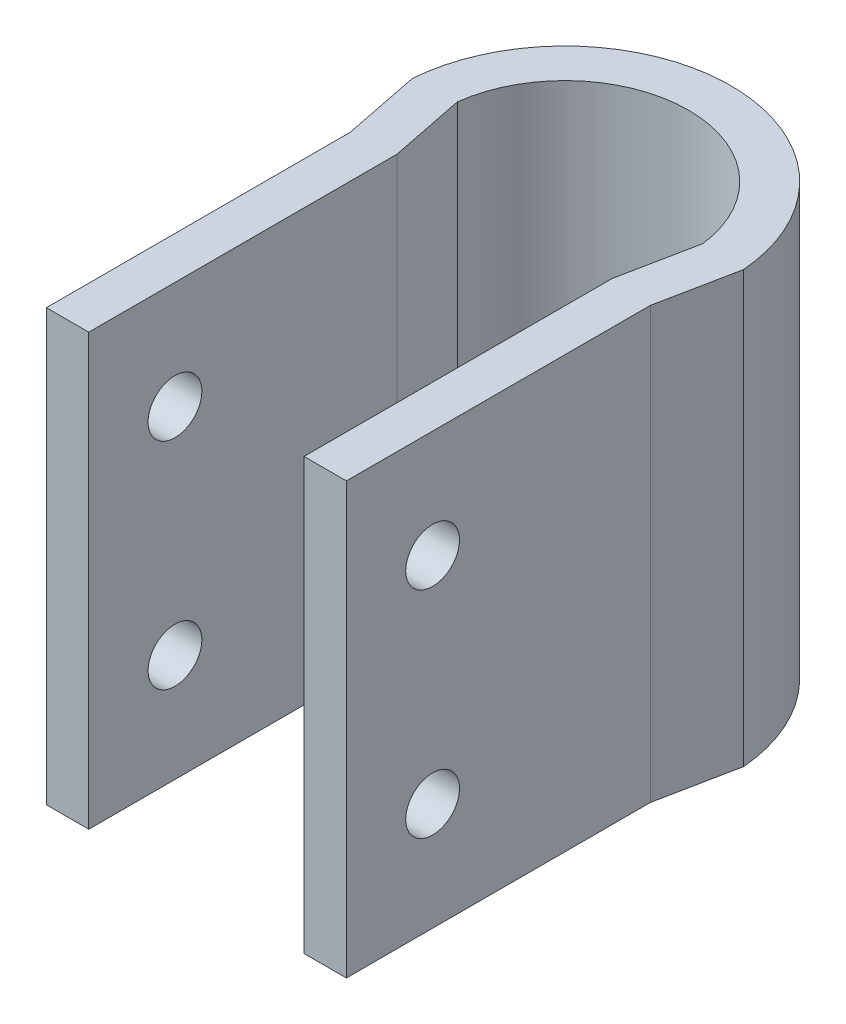
ISO-10303-21;
HEADER;
FILE_DESCRIPTION(('STEP AP214'),'2;1');
FILE_NAME('part.step','',(''),(''),'','','');
FILE_SCHEMA(('AUTOMOTIVE_DESIGN { 1 0 10303 214 1 1 1 1 }'));
ENDSEC;
DATA;
#1=APPLICATION_CONTEXT('core data for automotive mechanical design processes');
#2=APPLICATION_PROTOCOL_DEFINITION('international standard','automotive_design',2000,#1);
#3=PRODUCT_CONTEXT('',#1,'mechanical');
#4=PRODUCT('Part','Part','',(#3));
#5=PRODUCT_RELATED_PRODUCT_CATEGORY('part','',(#4));
#6=PRODUCT_DEFINITION_FORMATION('','',#4);
#7=PRODUCT_DEFINITION_CONTEXT('part definition',#1,'design');
#8=PRODUCT_DEFINITION('design','',#6,#7);
#9=PRODUCT_DEFINITION_SHAPE('','',#8);
#10=(LENGTH_UNIT() NAMED_UNIT(*) SI_UNIT(.MILLI.,.METRE.));
#11=(NAMED_UNIT(*) PLANE_ANGLE_UNIT() SI_UNIT($,.RADIAN.));
#12=(NAMED_UNIT(*) SI_UNIT($,.STERADIAN.) SOLID_ANGLE_UNIT());
#13=UNCERTAINTY_MEASURE_WITH_UNIT(LENGTH_MEASURE(1.E-05),#10,'distance_accuracy_value','');
#14=(GEOMETRIC_REPRESENTATION_CONTEXT(3) GLOBAL_UNCERTAINTY_ASSIGNED_CONTEXT((#13)) GLOBAL_UNIT_ASSIGNED_CONTEXT((#10,
#11,#12)) REPRESENTATION_CONTEXT('',''));
#15=CARTESIAN_POINT('',(0.,0.,0.));
#16=DIRECTION('',(0.,0.,1.));
#17=DIRECTION('',(1.,0.,0.));
#18=AXIS2_PLACEMENT_3D('',#15,#16,#17);
#19=CARTESIAN_POINT('',(-17.7,318.77,43.48));
#20=DIRECTION('',(0.,0.,1.));
#21=DIRECTION('',(1.,0.,0.));
#22=AXIS2_PLACEMENT_3D('',#19,#20,#21);
#23=PLANE('',#22);
#24=DIRECTION('',(1.,0.,0.));
#25=VECTOR('',#24,1.);
#26=CARTESIAN_POINT('',(-17.7,369.57,43.48));
#27=LINE('',#26,#25);
#28=CARTESIAN_POINT('',(-17.7,369.57,43.48));
#29=VERTEX_POINT('',#28);
#30=CARTESIAN_POINT('',(-12.7,369.57,43.48));
#31=VERTEX_POINT('',#30);
#32=EDGE_CURVE('E163',#29,#31,#27,.T.);
#33=ORIENTED_EDGE('',*,*,#32,.F.);
#34=DIRECTION('',(0.,1.,0.));
#35=VECTOR('',#34,1.);
#36=CARTESIAN_POINT('',(-17.7,318.77,43.48));
#37=LINE('',#36,#35);
#38=CARTESIAN_POINT('',(-17.7,318.77,43.48));
#39=VERTEX_POINT('',#38);
#40=EDGE_CURVE('E11',#39,#29,#37,.T.);
#41=ORIENTED_EDGE('',*,*,#40,.F.);
#42=DIRECTION('',(1.,0.,0.));
#43=VECTOR('',#42,1.);
#44=CARTESIAN_POINT('',(-17.7,318.77,43.48));
#45=LINE('',#44,#43);
#46=CARTESIAN_POINT('',(-12.7,318.77,43.48));
#47=VERTEX_POINT('',#46);
#48=EDGE_CURVE('E196',#39,#47,#45,.T.);
#49=ORIENTED_EDGE('',*,*,#48,.T.);
#50=DIRECTION('',(0.,1.,0.));
#51=VECTOR('',#50,1.);
#52=CARTESIAN_POINT('',(-12.7,318.77,43.48));
#53=LINE('',#52,#51);
#54=EDGE_CURVE('E109',#47,#31,#53,.T.);
#55=ORIENTED_EDGE('',*,*,#54,.T.);
#56=EDGE_LOOP('',(#33,#41,#49,#55));
#57=FACE_BOUND('',#56,.T.);
#58=ADVANCED_FACE('F41',(#57),#23,.T.);
#59=CARTESIAN_POINT('',(-17.7,318.77,43.48));
#60=DIRECTION('',(-1.,0.,0.));
#61=DIRECTION('',(0.,0.,1.));
#62=AXIS2_PLACEMENT_3D('',#59,#60,#61);
#63=PLANE('',#62);
#64=CARTESIAN_POINT('',(-17.7,356.87,33.305));
#65=DIRECTION('',(-1.,0.,0.));
#66=DIRECTION('',(0.,0.,1.));
#67=AXIS2_PLACEMENT_3D('',#64,#65,#66);
#68=CIRCLE('',#67,3.175);
#69=CARTESIAN_POINT('',(-17.7,356.87,36.48));
#70=VERTEX_POINT('',#69);
#71=EDGE_CURVE('E217',#70,#70,#68,.T.);
#72=ORIENTED_EDGE('',*,*,#71,.F.);
#73=EDGE_LOOP('',(#72));
#74=FACE_BOUND('',#73,.T.);
#75=CARTESIAN_POINT('',(-17.7,331.47,33.305));
#76=DIRECTION('',(-1.,0.,0.));
#77=DIRECTION('',(0.,0.,-1.));
#78=AXIS2_PLACEMENT_3D('',#75,#76,#77);
#79=CIRCLE('',#78,3.175);
#80=CARTESIAN_POINT('',(-17.7,331.47,30.13));
#81=VERTEX_POINT('',#80);
#82=EDGE_CURVE('E224',#81,#81,#79,.T.);
#83=ORIENTED_EDGE('',*,*,#82,.F.);
#84=EDGE_LOOP('',(#83));
#85=FACE_BOUND('',#84,.T.);
#86=DIRECTION('',(0.,0.,1.));
#87=VECTOR('',#86,1.);
#88=CARTESIAN_POINT('',(-17.7,369.57,43.48));
#89=LINE('',#88,#87);
#90=CARTESIAN_POINT('',(-17.7,369.57,7.61319175216006));
#91=VERTEX_POINT('',#90);
#92=EDGE_CURVE('E194',#91,#29,#89,.T.);
#93=ORIENTED_EDGE('',*,*,#92,.F.);
#94=DIRECTION('',(0.,1.,0.));
#95=VECTOR('',#94,1.);
#96=CARTESIAN_POINT('',(-17.7,318.77,7.61319175216006));
#97=LINE('',#96,#95);
#98=CARTESIAN_POINT('',(-17.7,318.77,7.61319175216006));
#99=VERTEX_POINT('',#98);
#100=EDGE_CURVE('E50',#99,#91,#97,.T.);
#101=ORIENTED_EDGE('',*,*,#100,.F.);
#102=DIRECTION('',(0.,0.,1.));
#103=VECTOR('',#102,1.);
#104=CARTESIAN_POINT('',(-17.7,318.77,43.48));
#105=LINE('',#104,#103);
#106=EDGE_CURVE('E153',#99,#39,#105,.T.);
#107=ORIENTED_EDGE('',*,*,#106,.T.);
#108=ORIENTED_EDGE('',*,*,#40,.T.);
#109=EDGE_LOOP('',(#93,#101,#107,#108));
#110=FACE_BOUND('',#109,.T.);
#111=ADVANCED_FACE('F284',(#74,#85,#110),#63,.T.);
#112=CARTESIAN_POINT('',(-17.7,318.77,7.61319175216006));
#113=DIRECTION('',(-0.980545317992595,0.,0.1962928408343));
#114=DIRECTION('',(0.1962928408343,0.,0.980545317992595));
#115=AXIS2_PLACEMENT_3D('',#112,#113,#114);
#116=PLANE('',#115);
#117=DIRECTION('',(0.1962928408343,0.,0.980545317992595));
#118=VECTOR('',#117,1.);
#119=CARTESIAN_POINT('',(-17.7,369.57,7.61319175216006));
#120=LINE('',#119,#118);
#121=CARTESIAN_POINT('',(-19.5338143213269,369.57,-1.54729540163647));
#122=VERTEX_POINT('',#121);
#123=EDGE_CURVE('E140',#122,#91,#120,.T.);
#124=ORIENTED_EDGE('',*,*,#123,.F.);
#125=DIRECTION('',(0.,1.,0.));
#126=VECTOR('',#125,1.);
#127=CARTESIAN_POINT('',(-19.5338143213269,318.77,-1.54729540163647));
#128=LINE('',#127,#126);
#129=CARTESIAN_POINT('',(-19.5338143213269,318.77,-1.54729540163647));
#130=VERTEX_POINT('',#129);
#131=EDGE_CURVE('E135',#130,#122,#128,.T.);
#132=ORIENTED_EDGE('',*,*,#131,.F.);
#133=DIRECTION('',(0.1962928408343,0.,0.980545317992595));
#134=VECTOR('',#133,1.);
#135=CARTESIAN_POINT('',(-17.7,318.77,7.61319175216006));
#136=LINE('',#135,#134);
#137=EDGE_CURVE('E138',#130,#99,#136,.T.);
#138=ORIENTED_EDGE('',*,*,#137,.T.);
#139=ORIENTED_EDGE('',*,*,#100,.T.);
#140=EDGE_LOOP('',(#124,#132,#138,#139));
#141=FACE_BOUND('',#140,.T.);
#142=ADVANCED_FACE('F137',(#141),#116,.T.);
#143=CARTESIAN_POINT('',(0.,318.77,0.));
#144=DIRECTION('',(0.,1.,0.));
#145=DIRECTION('',(0.,0.,1.));
#146=AXIS2_PLACEMENT_3D('',#143,#144,#145);
#147=CYLINDRICAL_SURFACE('',#146,19.595);
#148=CARTESIAN_POINT('',(0.,369.57,0.));
#149=DIRECTION('',(0.,1.,0.));
#150=DIRECTION('',(0.,0.,-1.));
#151=AXIS2_PLACEMENT_3D('',#148,#149,#150);
#152=CIRCLE('',#151,19.595);
#153=CARTESIAN_POINT('',(19.5338143213269,369.57,-1.54729540163646));
#154=VERTEX_POINT('',#153);
#155=EDGE_CURVE('E191',#154,#122,#152,.T.);
#156=ORIENTED_EDGE('',*,*,#155,.F.);
#157=DIRECTION('',(0.,1.,0.));
#158=VECTOR('',#157,1.);
#159=CARTESIAN_POINT('',(19.5338143213269,318.77,-1.54729540163646));
#160=LINE('',#159,#158);
#161=CARTESIAN_POINT('',(19.5338143213269,318.77,-1.54729540163646));
#162=VERTEX_POINT('',#161);
#163=EDGE_CURVE('E145',#162,#154,#160,.T.);
#164=ORIENTED_EDGE('',*,*,#163,.F.);
#165=CARTESIAN_POINT('',(0.,318.77,0.));
#166=DIRECTION('',(0.,1.,0.));
#167=DIRECTION('',(0.,0.,-1.));
#168=AXIS2_PLACEMENT_3D('',#165,#166,#167);
#169=CIRCLE('',#168,19.595);
#170=EDGE_CURVE('E151',#162,#130,#169,.T.);
#171=ORIENTED_EDGE('',*,*,#170,.T.);
#172=ORIENTED_EDGE('',*,*,#131,.T.);
#173=EDGE_LOOP('',(#156,#164,#171,#172));
#174=FACE_BOUND('',#173,.T.);
#175=ADVANCED_FACE('F155',(#174),#147,.T.);
#176=CARTESIAN_POINT('',(19.5338143213269,318.77,-1.54729540163646));
#177=DIRECTION('',(0.980545317992595,0.,0.1962928408343));
#178=DIRECTION('',(0.1962928408343,0.,-0.980545317992595));
#179=AXIS2_PLACEMENT_3D('',#176,#177,#178);
#180=PLANE('',#179);
#181=DIRECTION('',(0.1962928408343,0.,-0.980545317992596));
#182=VECTOR('',#181,1.);
#183=CARTESIAN_POINT('',(19.5338143213269,369.57,-1.54729540163646));
#184=LINE('',#183,#182);
#185=CARTESIAN_POINT('',(17.7,369.57,7.61319175216007));
#186=VERTEX_POINT('',#185);
#187=EDGE_CURVE('E188',#186,#154,#184,.T.);
#188=ORIENTED_EDGE('',*,*,#187,.F.);
#189=DIRECTION('',(0.,1.,0.));
#190=VECTOR('',#189,1.);
#191=CARTESIAN_POINT('',(17.7,318.77,7.61319175216007));
#192=LINE('',#191,#190);
#193=CARTESIAN_POINT('',(17.7,318.77,7.61319175216007));
#194=VERTEX_POINT('',#193);
#195=EDGE_CURVE('E200',#194,#186,#192,.T.);
#196=ORIENTED_EDGE('',*,*,#195,.F.);
#197=DIRECTION('',(0.1962928408343,0.,-0.980545317992596));
#198=VECTOR('',#197,1.);
#199=CARTESIAN_POINT('',(19.5338143213269,318.77,-1.54729540163646));
#200=LINE('',#199,#198);
#201=EDGE_CURVE('E156',#194,#162,#200,.T.);
#202=ORIENTED_EDGE('',*,*,#201,.T.);
#203=ORIENTED_EDGE('',*,*,#163,.T.);
#204=EDGE_LOOP('',(#188,#196,#202,#203));
#205=FACE_BOUND('',#204,.T.);
#206=ADVANCED_FACE('F300',(#205),#180,.T.);
#207=CARTESIAN_POINT('',(17.7,318.77,7.61319175216007));
#208=DIRECTION('',(1.,0.,0.));
#209=DIRECTION('',(0.,0.,-1.));
#210=AXIS2_PLACEMENT_3D('',#207,#208,#209);
#211=PLANE('',#210);
#212=CARTESIAN_POINT('',(17.7,356.87,33.305));
#213=DIRECTION('',(1.,0.,0.));
#214=DIRECTION('',(0.,0.,-1.));
#215=AXIS2_PLACEMENT_3D('',#212,#213,#214);
#216=CIRCLE('',#215,3.175);
#217=CARTESIAN_POINT('',(17.7,356.87,30.13));
#218=VERTEX_POINT('',#217);
#219=EDGE_CURVE('E167',#218,#218,#216,.T.);
#220=ORIENTED_EDGE('',*,*,#219,.F.);
#221=EDGE_LOOP('',(#220));
#222=FACE_BOUND('',#221,.T.);
#223=CARTESIAN_POINT('',(17.7,331.47,33.305));
#224=DIRECTION('',(1.,0.,0.));
#225=DIRECTION('',(0.,0.,-1.));
#226=AXIS2_PLACEMENT_3D('',#223,#224,#225);
#227=CIRCLE('',#226,3.175);
#228=CARTESIAN_POINT('',(17.7,331.47,30.13));
#229=VERTEX_POINT('',#228);
#230=EDGE_CURVE('E221',#229,#229,#227,.T.);
#231=ORIENTED_EDGE('',*,*,#230,.F.);
#232=EDGE_LOOP('',(#231));
#233=FACE_BOUND('',#232,.T.);
#234=DIRECTION('',(0.,0.,-1.));
#235=VECTOR('',#234,1.);
#236=CARTESIAN_POINT('',(17.7,369.57,7.61319175216007));
#237=LINE('',#236,#235);
#238=CARTESIAN_POINT('',(17.7,369.57,43.48));
#239=VERTEX_POINT('',#238);
#240=EDGE_CURVE('E185',#239,#186,#237,.T.);
#241=ORIENTED_EDGE('',*,*,#240,.F.);
#242=DIRECTION('',(0.,1.,0.));
#243=VECTOR('',#242,1.);
#244=CARTESIAN_POINT('',(17.7,318.77,43.48));
#245=LINE('',#244,#243);
#246=CARTESIAN_POINT('',(17.7,318.77,43.48));
#247=VERTEX_POINT('',#246);
#248=EDGE_CURVE('E202',#247,#239,#245,.T.);
#249=ORIENTED_EDGE('',*,*,#248,.F.);
#250=DIRECTION('',(0.,0.,-1.));
#251=VECTOR('',#250,1.);
#252=CARTESIAN_POINT('',(17.7,318.77,7.61319175216007));
#253=LINE('',#252,#251);
#254=EDGE_CURVE('E158',#247,#194,#253,.T.);
#255=ORIENTED_EDGE('',*,*,#254,.T.);
#256=ORIENTED_EDGE('',*,*,#195,.T.);
#257=EDGE_LOOP('',(#241,#249,#255,#256));
#258=FACE_BOUND('',#257,.T.);
#259=ADVANCED_FACE('F259',(#222,#233,#258),#211,.T.);
#260=CARTESIAN_POINT('',(12.7,318.77,43.48));
#261=DIRECTION('',(0.,0.,1.));
#262=DIRECTION('',(1.,0.,0.));
#263=AXIS2_PLACEMENT_3D('',#260,#261,#262);
#264=PLANE('',#263);
#265=DIRECTION('',(1.,0.,0.));
#266=VECTOR('',#265,1.);
#267=CARTESIAN_POINT('',(12.7,369.57,43.48));
#268=LINE('',#267,#266);
#269=CARTESIAN_POINT('',(12.7,369.57,43.48));
#270=VERTEX_POINT('',#269);
#271=EDGE_CURVE('E182',#270,#239,#268,.T.);
#272=ORIENTED_EDGE('',*,*,#271,.F.);
#273=DIRECTION('',(0.,1.,0.));
#274=VECTOR('',#273,1.);
#275=CARTESIAN_POINT('',(12.7,318.77,43.48));
#276=LINE('',#275,#274);
#277=CARTESIAN_POINT('',(12.7,318.77,43.48));
#278=VERTEX_POINT('',#277);
#279=EDGE_CURVE('E204',#278,#270,#276,.T.);
#280=ORIENTED_EDGE('',*,*,#279,.F.);
#281=DIRECTION('',(1.,0.,0.));
#282=VECTOR('',#281,1.);
#283=CARTESIAN_POINT('',(12.7,318.77,43.48));
#284=LINE('',#283,#282);
#285=EDGE_CURVE('E253',#278,#247,#284,.T.);
#286=ORIENTED_EDGE('',*,*,#285,.T.);
#287=ORIENTED_EDGE('',*,*,#248,.T.);
#288=EDGE_LOOP('',(#272,#280,#286,#287));
#289=FACE_BOUND('',#288,.T.);
#290=ADVANCED_FACE('F265',(#289),#264,.T.);
#291=CARTESIAN_POINT('',(12.7,318.77,7.11763924182101));
#292=DIRECTION('',(-1.,0.,0.));
#293=DIRECTION('',(0.,0.,1.));
#294=AXIS2_PLACEMENT_3D('',#291,#292,#293);
#295=PLANE('',#294);
#296=CARTESIAN_POINT('',(12.7,356.87,33.305));
#297=DIRECTION('',(-1.,0.,0.));
#298=DIRECTION('',(0.,0.,1.));
#299=AXIS2_PLACEMENT_3D('',#296,#297,#298);
#300=CIRCLE('',#299,3.175);
#301=CARTESIAN_POINT('',(12.7,356.87,36.48));
#302=VERTEX_POINT('',#301);
#303=EDGE_CURVE('E233',#302,#302,#300,.T.);
#304=ORIENTED_EDGE('',*,*,#303,.F.);
#305=EDGE_LOOP('',(#304));
#306=FACE_BOUND('',#305,.T.);
#307=CARTESIAN_POINT('',(12.7,331.47,33.305));
#308=DIRECTION('',(-1.,0.,0.));
#309=DIRECTION('',(0.,0.,1.));
#310=AXIS2_PLACEMENT_3D('',#307,#308,#309);
#311=CIRCLE('',#310,3.175);
#312=CARTESIAN_POINT('',(12.7,331.47,36.48));
#313=VERTEX_POINT('',#312);
#314=EDGE_CURVE('E216',#313,#313,#311,.T.);
#315=ORIENTED_EDGE('',*,*,#314,.F.);
#316=EDGE_LOOP('',(#315));
#317=FACE_BOUND('',#316,.T.);
#318=DIRECTION('',(0.,0.,1.));
#319=VECTOR('',#318,1.);
#320=CARTESIAN_POINT('',(12.7,369.57,7.11763924182101));
#321=LINE('',#320,#319);
#322=CARTESIAN_POINT('',(12.7,369.57,7.11763924182101));
#323=VERTEX_POINT('',#322);
#324=EDGE_CURVE('E179',#323,#270,#321,.T.);
#325=ORIENTED_EDGE('',*,*,#324,.F.);
#326=DIRECTION('',(0.,1.,0.));
#327=VECTOR('',#326,1.);
#328=CARTESIAN_POINT('',(12.7,318.77,7.11763924182101));
#329=LINE('',#328,#327);
#330=CARTESIAN_POINT('',(12.7,318.77,7.11763924182101));
#331=VERTEX_POINT('',#330);
#332=EDGE_CURVE('E206',#331,#323,#329,.T.);
#333=ORIENTED_EDGE('',*,*,#332,.F.);
#334=DIRECTION('',(0.,0.,1.));
#335=VECTOR('',#334,1.);
#336=CARTESIAN_POINT('',(12.7,318.77,7.11763924182101));
#337=LINE('',#336,#335);
#338=EDGE_CURVE('E250',#331,#278,#337,.T.);
#339=ORIENTED_EDGE('',*,*,#338,.T.);
#340=ORIENTED_EDGE('',*,*,#279,.T.);
#341=EDGE_LOOP('',(#325,#333,#339,#340));
#342=FACE_BOUND('',#341,.T.);
#343=ADVANCED_FACE('F268',(#306,#317,#342),#295,.T.);
#344=CARTESIAN_POINT('',(14.4841982864085,318.77,-1.795));
#345=DIRECTION('',(-0.980545317992595,0.,-0.1962928408343));
#346=DIRECTION('',(-0.1962928408343,0.,0.980545317992596));
#347=AXIS2_PLACEMENT_3D('',#344,#345,#346);
#348=PLANE('',#347);
#349=DIRECTION('',(-0.1962928408343,0.,0.980545317992595));
#350=VECTOR('',#349,1.);
#351=CARTESIAN_POINT('',(14.4841982864085,369.57,-1.795));
#352=LINE('',#351,#350);
#353=CARTESIAN_POINT('',(14.4841982864085,369.57,-1.795));
#354=VERTEX_POINT('',#353);
#355=EDGE_CURVE('E176',#354,#323,#352,.T.);
#356=ORIENTED_EDGE('',*,*,#355,.F.);
#357=DIRECTION('',(0.,1.,0.));
#358=VECTOR('',#357,1.);
#359=CARTESIAN_POINT('',(14.4841982864085,318.77,-1.795));
#360=LINE('',#359,#358);
#361=CARTESIAN_POINT('',(14.4841982864085,318.77,-1.795));
#362=VERTEX_POINT('',#361);
#363=EDGE_CURVE('E208',#362,#354,#360,.T.);
#364=ORIENTED_EDGE('',*,*,#363,.F.);
#365=DIRECTION('',(-0.1962928408343,0.,0.980545317992595));
#366=VECTOR('',#365,1.);
#367=CARTESIAN_POINT('',(14.4841982864085,318.77,-1.795));
#368=LINE('',#367,#366);
#369=EDGE_CURVE('E247',#362,#331,#368,.T.);
#370=ORIENTED_EDGE('',*,*,#369,.T.);
#371=ORIENTED_EDGE('',*,*,#332,.T.);
#372=EDGE_LOOP('',(#356,#364,#370,#371));
#373=FACE_BOUND('',#372,.T.);
#374=ADVANCED_FACE('F273',(#373),#348,.T.);
#375=CARTESIAN_POINT('',(0.,318.77,0.));
#376=DIRECTION('',(0.,1.,0.));
#377=DIRECTION('',(0.,0.,1.));
#378=AXIS2_PLACEMENT_3D('',#375,#376,#377);
#379=CYLINDRICAL_SURFACE('',#378,14.595);
#380=CARTESIAN_POINT('',(0.,369.57,0.));
#381=DIRECTION('',(0.,-1.,0.));
#382=DIRECTION('',(0.,0.,-1.));
#383=AXIS2_PLACEMENT_3D('',#380,#381,#382);
#384=CIRCLE('',#383,14.595);
#385=CARTESIAN_POINT('',(-14.4841982864085,369.57,-1.795));
#386=VERTEX_POINT('',#385);
#387=EDGE_CURVE('E173',#386,#354,#384,.T.);
#388=ORIENTED_EDGE('',*,*,#387,.F.);
#389=DIRECTION('',(0.,1.,0.));
#390=VECTOR('',#389,1.);
#391=CARTESIAN_POINT('',(-14.4841982864085,318.77,-1.795));
#392=LINE('',#391,#390);
#393=CARTESIAN_POINT('',(-14.4841982864085,318.77,-1.795));
#394=VERTEX_POINT('',#393);
#395=EDGE_CURVE('E210',#394,#386,#392,.T.);
#396=ORIENTED_EDGE('',*,*,#395,.F.);
#397=CARTESIAN_POINT('',(0.,318.77,0.));
#398=DIRECTION('',(0.,-1.,0.));
#399=DIRECTION('',(0.,0.,-1.));
#400=AXIS2_PLACEMENT_3D('',#397,#398,#399);
#401=CIRCLE('',#400,14.595);
#402=EDGE_CURVE('E244',#394,#362,#401,.T.);
#403=ORIENTED_EDGE('',*,*,#402,.T.);
#404=ORIENTED_EDGE('',*,*,#363,.T.);
#405=EDGE_LOOP('',(#388,#396,#403,#404));
#406=FACE_BOUND('',#405,.T.);
#407=ADVANCED_FACE('F276',(#406),#379,.F.);
#408=CARTESIAN_POINT('',(-12.7,318.77,7.11763924182101));
#409=DIRECTION('',(0.980545317992595,0.,-0.1962928408343));
#410=DIRECTION('',(-0.1962928408343,0.,-0.980545317992596));
#411=AXIS2_PLACEMENT_3D('',#408,#409,#410);
#412=PLANE('',#411);
#413=DIRECTION('',(-0.1962928408343,0.,-0.980545317992595));
#414=VECTOR('',#413,1.);
#415=CARTESIAN_POINT('',(-12.7,369.57,7.11763924182101));
#416=LINE('',#415,#414);
#417=CARTESIAN_POINT('',(-12.7,369.57,7.11763924182101));
#418=VERTEX_POINT('',#417);
#419=EDGE_CURVE('E170',#418,#386,#416,.T.);
#420=ORIENTED_EDGE('',*,*,#419,.F.);
#421=DIRECTION('',(0.,1.,0.));
#422=VECTOR('',#421,1.);
#423=CARTESIAN_POINT('',(-12.7,318.77,7.11763924182101));
#424=LINE('',#423,#422);
#425=CARTESIAN_POINT('',(-12.7,318.77,7.11763924182101));
#426=VERTEX_POINT('',#425);
#427=EDGE_CURVE('E212',#426,#418,#424,.T.);
#428=ORIENTED_EDGE('',*,*,#427,.F.);
#429=DIRECTION('',(-0.1962928408343,0.,-0.980545317992595));
#430=VECTOR('',#429,1.);
#431=CARTESIAN_POINT('',(-12.7,318.77,7.11763924182101));
#432=LINE('',#431,#430);
#433=EDGE_CURVE('E241',#426,#394,#432,.T.);
#434=ORIENTED_EDGE('',*,*,#433,.T.);
#435=ORIENTED_EDGE('',*,*,#395,.T.);
#436=EDGE_LOOP('',(#420,#428,#434,#435));
#437=FACE_BOUND('',#436,.T.);
#438=ADVANCED_FACE('F280',(#437),#412,.T.);
#439=CARTESIAN_POINT('',(-12.7,318.77,43.48));
#440=DIRECTION('',(1.,0.,0.));
#441=DIRECTION('',(0.,0.,-1.));
#442=AXIS2_PLACEMENT_3D('',#439,#440,#441);
#443=PLANE('',#442);
#444=CARTESIAN_POINT('',(-12.7,356.87,33.305));
#445=DIRECTION('',(1.,0.,0.));
#446=DIRECTION('',(0.,0.,-1.));
#447=AXIS2_PLACEMENT_3D('',#444,#445,#446);
#448=CIRCLE('',#447,3.175);
#449=CARTESIAN_POINT('',(-12.7,356.87,30.13));
#450=VERTEX_POINT('',#449);
#451=EDGE_CURVE('E44',#450,#450,#448,.T.);
#452=ORIENTED_EDGE('',*,*,#451,.F.);
#453=EDGE_LOOP('',(#452));
#454=FACE_BOUND('',#453,.T.);
#455=CARTESIAN_POINT('',(-12.7,331.47,33.305));
#456=DIRECTION('',(1.,0.,0.));
#457=DIRECTION('',(0.,0.,-1.));
#458=AXIS2_PLACEMENT_3D('',#455,#456,#457);
#459=CIRCLE('',#458,3.175);
#460=CARTESIAN_POINT('',(-12.7,331.47,30.13));
#461=VERTEX_POINT('',#460);
#462=EDGE_CURVE('E214',#461,#461,#459,.T.);
#463=ORIENTED_EDGE('',*,*,#462,.F.);
#464=EDGE_LOOP('',(#463));
#465=FACE_BOUND('',#464,.T.);
#466=DIRECTION('',(0.,0.,-1.));
#467=VECTOR('',#466,1.);
#468=CARTESIAN_POINT('',(-12.7,369.57,43.48));
#469=LINE('',#468,#467);
#470=EDGE_CURVE('E166',#31,#418,#469,.T.);
#471=ORIENTED_EDGE('',*,*,#470,.F.);
#472=ORIENTED_EDGE('',*,*,#54,.F.);
#473=DIRECTION('',(0.,0.,-1.));
#474=VECTOR('',#473,1.);
#475=CARTESIAN_POINT('',(-12.7,318.77,43.48));
#476=LINE('',#475,#474);
#477=EDGE_CURVE('E239',#47,#426,#476,.T.);
#478=ORIENTED_EDGE('',*,*,#477,.T.);
#479=ORIENTED_EDGE('',*,*,#427,.T.);
#480=EDGE_LOOP('',(#471,#472,#478,#479));
#481=FACE_BOUND('',#480,.T.);
#482=ADVANCED_FACE('F281',(#454,#465,#481),#443,.T.);
#483=CARTESIAN_POINT('',(0.,318.77,0.));
#484=DIRECTION('',(0.,-1.,0.));
#485=DIRECTION('',(0.,0.,-1.));
#486=AXIS2_PLACEMENT_3D('',#483,#484,#485);
#487=PLANE('',#486);
#488=ORIENTED_EDGE('',*,*,#48,.F.);
#489=ORIENTED_EDGE('',*,*,#106,.F.);
#490=ORIENTED_EDGE('',*,*,#137,.F.);
#491=ORIENTED_EDGE('',*,*,#170,.F.);
#492=ORIENTED_EDGE('',*,*,#201,.F.);
#493=ORIENTED_EDGE('',*,*,#254,.F.);
#494=ORIENTED_EDGE('',*,*,#285,.F.);
#495=ORIENTED_EDGE('',*,*,#338,.F.);
#496=ORIENTED_EDGE('',*,*,#369,.F.);
#497=ORIENTED_EDGE('',*,*,#402,.F.);
#498=ORIENTED_EDGE('',*,*,#433,.F.);
#499=ORIENTED_EDGE('',*,*,#477,.F.);
#500=EDGE_LOOP('',(#488,#489,#490,#491,#492,#493,#494,#495,#496,#497,#498,#499));
#501=FACE_BOUND('',#500,.T.);
#502=ADVANCED_FACE('F149',(#501),#487,.T.);
#503=CARTESIAN_POINT('',(0.,369.57,0.));
#504=DIRECTION('',(0.,-1.,0.));
#505=DIRECTION('',(0.,0.,-1.));
#506=AXIS2_PLACEMENT_3D('',#503,#504,#505);
#507=PLANE('',#506);
#508=ORIENTED_EDGE('',*,*,#32,.T.);
#509=ORIENTED_EDGE('',*,*,#470,.T.);
#510=ORIENTED_EDGE('',*,*,#419,.T.);
#511=ORIENTED_EDGE('',*,*,#387,.T.);
#512=ORIENTED_EDGE('',*,*,#355,.T.);
#513=ORIENTED_EDGE('',*,*,#324,.T.);
#514=ORIENTED_EDGE('',*,*,#271,.T.);
#515=ORIENTED_EDGE('',*,*,#240,.T.);
#516=ORIENTED_EDGE('',*,*,#187,.T.);
#517=ORIENTED_EDGE('',*,*,#155,.T.);
#518=ORIENTED_EDGE('',*,*,#123,.T.);
#519=ORIENTED_EDGE('',*,*,#92,.T.);
#520=EDGE_LOOP('',(#508,#509,#510,#511,#512,#513,#514,#515,#516,#517,#518,#519));
#521=FACE_BOUND('',#520,.T.);
#522=ADVANCED_FACE('F283',(#521),#507,.F.);
#523=CARTESIAN_POINT('',(19.5338143213269,331.47,33.305));
#524=DIRECTION('',(-1.,0.,0.));
#525=DIRECTION('',(0.,0.,1.));
#526=AXIS2_PLACEMENT_3D('',#523,#524,#525);
#527=CYLINDRICAL_SURFACE('',#526,3.175);
#528=ORIENTED_EDGE('',*,*,#462,.T.);
#529=EDGE_LOOP('',(#528));
#530=FACE_BOUND('',#529,.T.);
#531=ORIENTED_EDGE('',*,*,#82,.T.);
#532=EDGE_LOOP('',(#531));
#533=FACE_BOUND('',#532,.T.);
#534=ADVANCED_FACE('F330',(#530,#533),#527,.F.);
#535=CARTESIAN_POINT('',(19.5338143213269,356.87,33.305));
#536=DIRECTION('',(-1.,0.,0.));
#537=DIRECTION('',(0.,0.,1.));
#538=AXIS2_PLACEMENT_3D('',#535,#536,#537);
#539=CYLINDRICAL_SURFACE('',#538,3.175);
#540=ORIENTED_EDGE('',*,*,#451,.T.);
#541=EDGE_LOOP('',(#540));
#542=FACE_BOUND('',#541,.T.);
#543=ORIENTED_EDGE('',*,*,#71,.T.);
#544=EDGE_LOOP('',(#543));
#545=FACE_BOUND('',#544,.T.);
#546=ADVANCED_FACE('F327',(#542,#545),#539,.F.);
#547=ORIENTED_EDGE('',*,*,#230,.T.);
#548=EDGE_LOOP('',(#547));
#549=FACE_BOUND('',#548,.T.);
#550=ORIENTED_EDGE('',*,*,#314,.T.);
#551=EDGE_LOOP('',(#550));
#552=FACE_BOUND('',#551,.T.);
#553=ADVANCED_FACE('F329',(#549,#552),#527,.F.);
#554=ORIENTED_EDGE('',*,*,#219,.T.);
#555=EDGE_LOOP('',(#554));
#556=FACE_BOUND('',#555,.T.);
#557=ORIENTED_EDGE('',*,*,#303,.T.);
#558=EDGE_LOOP('',(#557));
#559=FACE_BOUND('',#558,.T.);
#560=ADVANCED_FACE('F332',(#556,#559),#539,.F.);
#561=CLOSED_SHELL('',(#58,#111,#142,#175,#206,#259,#290,#343,#374,#407,#438,#482,#502,#522,#534,
#546,#553,#560));
#562=MANIFOLD_SOLID_BREP('B2',#561);
#563=ADVANCED_BREP_SHAPE_REPRESENTATION('',(#18,#562),#14);
#564=SHAPE_DEFINITION_REPRESENTATION(#9,#563);
ENDSEC;
END-ISO-10303-21;
